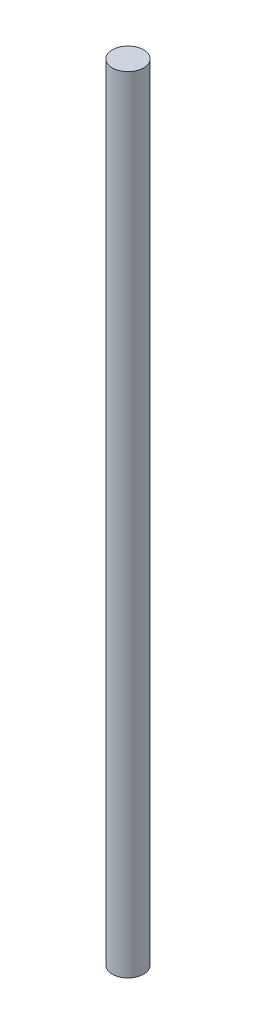
ISO-10303-21;
HEADER;
FILE_DESCRIPTION(('STEP AP214'),'2;1');
FILE_NAME('part.step','',(''),(''),'','','');
FILE_SCHEMA(('AUTOMOTIVE_DESIGN { 1 0 10303 214 1 1 1 1 }'));
ENDSEC;
DATA;
#1=APPLICATION_CONTEXT('core data for automotive mechanical design processes');
#2=APPLICATION_PROTOCOL_DEFINITION('international standard','automotive_design',2000,#1);
#3=PRODUCT_CONTEXT('',#1,'mechanical');
#4=PRODUCT('Part','Part','',(#3));
#5=PRODUCT_RELATED_PRODUCT_CATEGORY('part','',(#4));
#6=PRODUCT_DEFINITION_FORMATION('','',#4);
#7=PRODUCT_DEFINITION_CONTEXT('part definition',#1,'design');
#8=PRODUCT_DEFINITION('design','',#6,#7);
#9=PRODUCT_DEFINITION_SHAPE('','',#8);
#10=(LENGTH_UNIT() NAMED_UNIT(*) SI_UNIT(.MILLI.,.METRE.));
#11=(NAMED_UNIT(*) PLANE_ANGLE_UNIT() SI_UNIT($,.RADIAN.));
#12=(NAMED_UNIT(*) SI_UNIT($,.STERADIAN.) SOLID_ANGLE_UNIT());
#13=UNCERTAINTY_MEASURE_WITH_UNIT(LENGTH_MEASURE(1.E-05),#10,'distance_accuracy_value','');
#14=(GEOMETRIC_REPRESENTATION_CONTEXT(3) GLOBAL_UNCERTAINTY_ASSIGNED_CONTEXT((#13)) GLOBAL_UNIT_ASSIGNED_CONTEXT((#10,
#11,#12)) REPRESENTATION_CONTEXT('',''));
#15=CARTESIAN_POINT('',(0.,0.,0.));
#16=DIRECTION('',(0.,0.,1.));
#17=DIRECTION('',(1.,0.,0.));
#18=AXIS2_PLACEMENT_3D('',#15,#16,#17);
#19=CARTESIAN_POINT('',(0.,127.,0.));
#20=DIRECTION('',(0.,-1.,0.));
#21=DIRECTION('',(0.,0.,-1.));
#22=AXIS2_PLACEMENT_3D('',#19,#20,#21);
#23=CYLINDRICAL_SURFACE('',#22,2.54);
#24=CARTESIAN_POINT('',(0.,127.,0.));
#25=DIRECTION('',(0.,1.,0.));
#26=DIRECTION('',(0.,0.,1.));
#27=AXIS2_PLACEMENT_3D('',#24,#25,#26);
#28=CIRCLE('',#27,2.54);
#29=CARTESIAN_POINT('',(0.,127.,2.54));
#30=VERTEX_POINT('',#29);
#31=EDGE_CURVE('E10',#30,#30,#28,.T.);
#32=ORIENTED_EDGE('',*,*,#31,.F.);
#33=EDGE_LOOP('',(#32));
#34=FACE_BOUND('',#33,.T.);
#35=CARTESIAN_POINT('',(0.,0.,0.));
#36=DIRECTION('',(0.,1.,0.));
#37=DIRECTION('',(0.,0.,1.));
#38=AXIS2_PLACEMENT_3D('',#35,#36,#37);
#39=CIRCLE('',#38,2.54);
#40=CARTESIAN_POINT('',(0.,0.,2.54));
#41=VERTEX_POINT('',#40);
#42=EDGE_CURVE('E40',#41,#41,#39,.T.);
#43=ORIENTED_EDGE('',*,*,#42,.T.);
#44=EDGE_LOOP('',(#43));
#45=FACE_BOUND('',#44,.T.);
#46=ADVANCED_FACE('F37',(#34,#45),#23,.T.);
#47=CARTESIAN_POINT('',(0.,127.,0.));
#48=DIRECTION('',(0.,1.,0.));
#49=DIRECTION('',(0.,0.,1.));
#50=AXIS2_PLACEMENT_3D('',#47,#48,#49);
#51=PLANE('',#50);
#52=ORIENTED_EDGE('',*,*,#31,.T.);
#53=EDGE_LOOP('',(#52));
#54=FACE_BOUND('',#53,.T.);
#55=ADVANCED_FACE('F54',(#54),#51,.T.);
#56=CARTESIAN_POINT('',(0.,0.,0.));
#57=DIRECTION('',(0.,1.,0.));
#58=DIRECTION('',(0.,0.,1.));
#59=AXIS2_PLACEMENT_3D('',#56,#57,#58);
#60=PLANE('',#59);
#61=ORIENTED_EDGE('',*,*,#42,.F.);
#62=EDGE_LOOP('',(#61));
#63=FACE_BOUND('',#62,.T.);
#64=ADVANCED_FACE('F52',(#63),#60,.F.);
#65=CLOSED_SHELL('',(#46,#55,#64));
#66=MANIFOLD_SOLID_BREP('B2',#65);
#67=ADVANCED_BREP_SHAPE_REPRESENTATION('',(#18,#66),#14);
#68=SHAPE_DEFINITION_REPRESENTATION(#9,#67);
ENDSEC;
END-ISO-10303-21;
